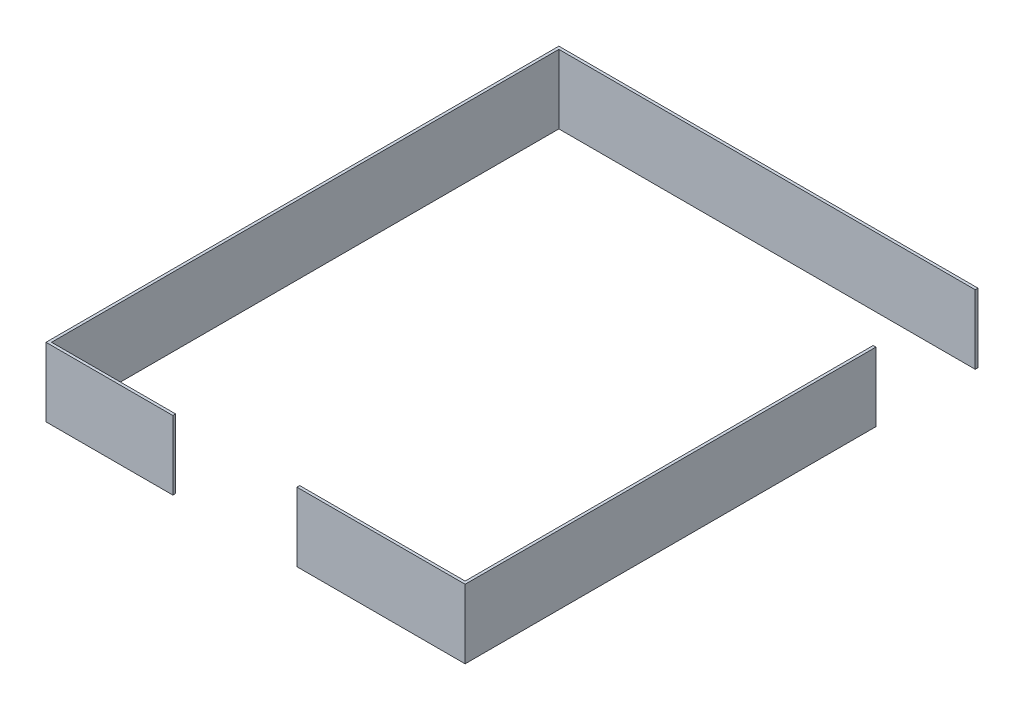
ISO-10303-21;
HEADER;
FILE_DESCRIPTION(('STEP AP214'),'2;1');
FILE_NAME('part.step','',(''),(''),'','','');
FILE_SCHEMA(('AUTOMOTIVE_DESIGN { 1 0 10303 214 1 1 1 1 }'));
ENDSEC;
DATA;
#1=APPLICATION_CONTEXT('core data for automotive mechanical design processes');
#2=APPLICATION_PROTOCOL_DEFINITION('international standard','automotive_design',2000,#1);
#3=PRODUCT_CONTEXT('',#1,'mechanical');
#4=PRODUCT('Part','Part','',(#3));
#5=PRODUCT_RELATED_PRODUCT_CATEGORY('part','',(#4));
#6=PRODUCT_DEFINITION_FORMATION('','',#4);
#7=PRODUCT_DEFINITION_CONTEXT('part definition',#1,'design');
#8=PRODUCT_DEFINITION('design','',#6,#7);
#9=PRODUCT_DEFINITION_SHAPE('','',#8);
#10=(LENGTH_UNIT() NAMED_UNIT(*) SI_UNIT(.MILLI.,.METRE.));
#11=(NAMED_UNIT(*) PLANE_ANGLE_UNIT() SI_UNIT($,.RADIAN.));
#12=(NAMED_UNIT(*) SI_UNIT($,.STERADIAN.) SOLID_ANGLE_UNIT());
#13=UNCERTAINTY_MEASURE_WITH_UNIT(LENGTH_MEASURE(1.E-05),#10,'distance_accuracy_value','');
#14=(GEOMETRIC_REPRESENTATION_CONTEXT(3) GLOBAL_UNCERTAINTY_ASSIGNED_CONTEXT((#13)) GLOBAL_UNIT_ASSIGNED_CONTEXT((#10,
#11,#12)) REPRESENTATION_CONTEXT('',''));
#15=CARTESIAN_POINT('',(0.,0.,0.));
#16=DIRECTION('',(0.,0.,1.));
#17=DIRECTION('',(1.,0.,0.));
#18=AXIS2_PLACEMENT_3D('',#15,#16,#17);
#19=CARTESIAN_POINT('',(0.,250.,0.));
#20=DIRECTION('',(0.,0.,-1.));
#21=DIRECTION('',(-1.,0.,0.));
#22=AXIS2_PLACEMENT_3D('',#19,#20,#21);
#23=PLANE('',#22);
#24=DIRECTION('',(1.,0.,0.));
#25=VECTOR('',#24,1.);
#26=CARTESIAN_POINT('',(0.,250.,0.));
#27=LINE('',#26,#25);
#28=CARTESIAN_POINT('',(0.,250.,0.));
#29=VERTEX_POINT('',#28);
#30=CARTESIAN_POINT('',(600.,250.,0.));
#31=VERTEX_POINT('',#30);
#32=EDGE_CURVE('E107',#29,#31,#27,.T.);
#33=ORIENTED_EDGE('',*,*,#32,.T.);
#34=DIRECTION('',(0.,-1.,0.));
#35=VECTOR('',#34,1.);
#36=CARTESIAN_POINT('',(600.,250.,0.));
#37=LINE('',#36,#35);
#38=CARTESIAN_POINT('',(600.,0.,0.));
#39=VERTEX_POINT('',#38);
#40=EDGE_CURVE('E123',#31,#39,#37,.T.);
#41=ORIENTED_EDGE('',*,*,#40,.T.);
#42=DIRECTION('',(1.,0.,0.));
#43=VECTOR('',#42,1.);
#44=CARTESIAN_POINT('',(0.,0.,0.));
#45=LINE('',#44,#43);
#46=CARTESIAN_POINT('',(0.,0.,0.));
#47=VERTEX_POINT('',#46);
#48=EDGE_CURVE('E136',#47,#39,#45,.T.);
#49=ORIENTED_EDGE('',*,*,#48,.F.);
#50=DIRECTION('',(0.,-1.,0.));
#51=VECTOR('',#50,1.);
#52=CARTESIAN_POINT('',(0.,250.,0.));
#53=LINE('',#52,#51);
#54=EDGE_CURVE('E12',#29,#47,#53,.T.);
#55=ORIENTED_EDGE('',*,*,#54,.F.);
#56=EDGE_LOOP('',(#33,#41,#49,#55));
#57=FACE_BOUND('',#56,.T.);
#58=ADVANCED_FACE('F43',(#57),#23,.T.);
#59=CARTESIAN_POINT('',(610.,250.,0.));
#60=DIRECTION('',(1.,0.,0.));
#61=DIRECTION('',(0.,0.,-1.));
#62=AXIS2_PLACEMENT_3D('',#59,#60,#61);
#63=PLANE('',#62);
#64=DIRECTION('',(0.,0.,1.));
#65=VECTOR('',#64,1.);
#66=CARTESIAN_POINT('',(610.,0.,0.));
#67=LINE('',#66,#65);
#68=CARTESIAN_POINT('',(610.,0.,-1480.));
#69=VERTEX_POINT('',#68);
#70=CARTESIAN_POINT('',(610.,0.,10.));
#71=VERTEX_POINT('',#70);
#72=EDGE_CURVE('E113',#69,#71,#67,.T.);
#73=ORIENTED_EDGE('',*,*,#72,.F.);
#74=DIRECTION('',(0.,-1.,0.));
#75=VECTOR('',#74,1.);
#76=CARTESIAN_POINT('',(610.,250.,-1480.));
#77=LINE('',#76,#75);
#78=CARTESIAN_POINT('',(610.,250.,-1480.));
#79=VERTEX_POINT('',#78);
#80=EDGE_CURVE('E111',#79,#69,#77,.T.);
#81=ORIENTED_EDGE('',*,*,#80,.F.);
#82=DIRECTION('',(0.,0.,1.));
#83=VECTOR('',#82,1.);
#84=CARTESIAN_POINT('',(610.,250.,0.));
#85=LINE('',#84,#83);
#86=CARTESIAN_POINT('',(610.,250.,10.));
#87=VERTEX_POINT('',#86);
#88=EDGE_CURVE('E102',#79,#87,#85,.T.);
#89=ORIENTED_EDGE('',*,*,#88,.T.);
#90=DIRECTION('',(0.,-1.,0.));
#91=VECTOR('',#90,1.);
#92=CARTESIAN_POINT('',(610.,250.,10.));
#93=LINE('',#92,#91);
#94=EDGE_CURVE('E83',#87,#71,#93,.T.);
#95=ORIENTED_EDGE('',*,*,#94,.T.);
#96=EDGE_LOOP('',(#73,#81,#89,#95));
#97=FACE_BOUND('',#96,.T.);
#98=ADVANCED_FACE('F45',(#97),#63,.T.);
#99=CARTESIAN_POINT('',(0.,250.,0.));
#100=DIRECTION('',(1.,0.,0.));
#101=DIRECTION('',(0.,0.,-1.));
#102=AXIS2_PLACEMENT_3D('',#99,#100,#101);
#103=PLANE('',#102);
#104=DIRECTION('',(0.,0.,1.));
#105=VECTOR('',#104,1.);
#106=CARTESIAN_POINT('',(0.,0.,0.));
#107=LINE('',#106,#105);
#108=CARTESIAN_POINT('',(0.,0.,10.));
#109=VERTEX_POINT('',#108);
#110=EDGE_CURVE('E139',#47,#109,#107,.T.);
#111=ORIENTED_EDGE('',*,*,#110,.T.);
#112=DIRECTION('',(0.,-1.,0.));
#113=VECTOR('',#112,1.);
#114=CARTESIAN_POINT('',(0.,250.,10.));
#115=LINE('',#114,#113);
#116=CARTESIAN_POINT('',(0.,250.,10.));
#117=VERTEX_POINT('',#116);
#118=EDGE_CURVE('E51',#117,#109,#115,.T.);
#119=ORIENTED_EDGE('',*,*,#118,.F.);
#120=DIRECTION('',(0.,0.,1.));
#121=VECTOR('',#120,1.);
#122=CARTESIAN_POINT('',(0.,250.,0.));
#123=LINE('',#122,#121);
#124=EDGE_CURVE('E132',#29,#117,#123,.T.);
#125=ORIENTED_EDGE('',*,*,#124,.F.);
#126=ORIENTED_EDGE('',*,*,#54,.T.);
#127=EDGE_LOOP('',(#111,#119,#125,#126));
#128=FACE_BOUND('',#127,.T.);
#129=ADVANCED_FACE('F153',(#128),#103,.F.);
#130=CARTESIAN_POINT('',(0.,250.,10.));
#131=DIRECTION('',(0.,0.,-1.));
#132=DIRECTION('',(-1.,0.,0.));
#133=AXIS2_PLACEMENT_3D('',#130,#131,#132);
#134=PLANE('',#133);
#135=DIRECTION('',(1.,0.,0.));
#136=VECTOR('',#135,1.);
#137=CARTESIAN_POINT('',(0.,0.,10.));
#138=LINE('',#137,#136);
#139=EDGE_CURVE('E108',#109,#71,#138,.T.);
#140=ORIENTED_EDGE('',*,*,#139,.T.);
#141=ORIENTED_EDGE('',*,*,#94,.F.);
#142=DIRECTION('',(1.,0.,0.));
#143=VECTOR('',#142,1.);
#144=CARTESIAN_POINT('',(0.,250.,10.));
#145=LINE('',#144,#143);
#146=EDGE_CURVE('E67',#117,#87,#145,.T.);
#147=ORIENTED_EDGE('',*,*,#146,.F.);
#148=ORIENTED_EDGE('',*,*,#118,.T.);
#149=EDGE_LOOP('',(#140,#141,#147,#148));
#150=FACE_BOUND('',#149,.T.);
#151=ADVANCED_FACE('F146',(#150),#134,.F.);
#152=CARTESIAN_POINT('',(0.,250.,0.));
#153=DIRECTION('',(0.,1.,0.));
#154=DIRECTION('',(0.,0.,1.));
#155=AXIS2_PLACEMENT_3D('',#152,#153,#154);
#156=PLANE('',#155);
#157=ORIENTED_EDGE('',*,*,#88,.F.);
#158=DIRECTION('',(1.,0.,0.));
#159=VECTOR('',#158,1.);
#160=CARTESIAN_POINT('',(0.,250.,-1480.));
#161=LINE('',#160,#159);
#162=CARTESIAN_POINT('',(600.,250.,-1480.));
#163=VERTEX_POINT('',#162);
#164=EDGE_CURVE('E106',#163,#79,#161,.T.);
#165=ORIENTED_EDGE('',*,*,#164,.F.);
#166=DIRECTION('',(0.,0.,1.));
#167=VECTOR('',#166,1.);
#168=CARTESIAN_POINT('',(600.,250.,0.));
#169=LINE('',#168,#167);
#170=EDGE_CURVE('E121',#163,#31,#169,.T.);
#171=ORIENTED_EDGE('',*,*,#170,.T.);
#172=ORIENTED_EDGE('',*,*,#32,.F.);
#173=ORIENTED_EDGE('',*,*,#124,.T.);
#174=ORIENTED_EDGE('',*,*,#146,.T.);
#175=EDGE_LOOP('',(#157,#165,#171,#172,#173,#174));
#176=FACE_BOUND('',#175,.T.);
#177=ADVANCED_FACE('F104',(#176),#156,.T.);
#178=CARTESIAN_POINT('',(0.,0.,0.));
#179=DIRECTION('',(0.,1.,0.));
#180=DIRECTION('',(0.,0.,1.));
#181=AXIS2_PLACEMENT_3D('',#178,#179,#180);
#182=PLANE('',#181);
#183=ORIENTED_EDGE('',*,*,#72,.T.);
#184=ORIENTED_EDGE('',*,*,#139,.F.);
#185=ORIENTED_EDGE('',*,*,#110,.F.);
#186=ORIENTED_EDGE('',*,*,#48,.T.);
#187=DIRECTION('',(0.,0.,1.));
#188=VECTOR('',#187,1.);
#189=CARTESIAN_POINT('',(600.,0.,0.));
#190=LINE('',#189,#188);
#191=CARTESIAN_POINT('',(600.,0.,-1480.));
#192=VERTEX_POINT('',#191);
#193=EDGE_CURVE('E58',#192,#39,#190,.T.);
#194=ORIENTED_EDGE('',*,*,#193,.F.);
#195=DIRECTION('',(1.,0.,0.));
#196=VECTOR('',#195,1.);
#197=CARTESIAN_POINT('',(0.,0.,-1480.));
#198=LINE('',#197,#196);
#199=EDGE_CURVE('E125',#192,#69,#198,.T.);
#200=ORIENTED_EDGE('',*,*,#199,.T.);
#201=EDGE_LOOP('',(#183,#184,#185,#186,#194,#200));
#202=FACE_BOUND('',#201,.T.);
#203=ADVANCED_FACE('F150',(#202),#182,.F.);
#204=CARTESIAN_POINT('',(0.,250.,-1480.));
#205=DIRECTION('',(0.,0.,-1.));
#206=DIRECTION('',(-1.,0.,0.));
#207=AXIS2_PLACEMENT_3D('',#204,#205,#206);
#208=PLANE('',#207);
#209=ORIENTED_EDGE('',*,*,#199,.F.);
#210=DIRECTION('',(0.,-1.,0.));
#211=VECTOR('',#210,1.);
#212=CARTESIAN_POINT('',(600.,250.,-1480.));
#213=LINE('',#212,#211);
#214=EDGE_CURVE('E117',#163,#192,#213,.T.);
#215=ORIENTED_EDGE('',*,*,#214,.F.);
#216=ORIENTED_EDGE('',*,*,#164,.T.);
#217=ORIENTED_EDGE('',*,*,#80,.T.);
#218=EDGE_LOOP('',(#209,#215,#216,#217));
#219=FACE_BOUND('',#218,.T.);
#220=ADVANCED_FACE('F119',(#219),#208,.T.);
#221=CARTESIAN_POINT('',(600.,250.,0.));
#222=DIRECTION('',(1.,0.,0.));
#223=DIRECTION('',(0.,0.,-1.));
#224=AXIS2_PLACEMENT_3D('',#221,#222,#223);
#225=PLANE('',#224);
#226=ORIENTED_EDGE('',*,*,#193,.T.);
#227=ORIENTED_EDGE('',*,*,#40,.F.);
#228=ORIENTED_EDGE('',*,*,#170,.F.);
#229=ORIENTED_EDGE('',*,*,#214,.T.);
#230=EDGE_LOOP('',(#226,#227,#228,#229));
#231=FACE_BOUND('',#230,.T.);
#232=ADVANCED_FACE('F152',(#231),#225,.F.);
#233=CLOSED_SHELL('',(#58,#98,#129,#151,#177,#203,#220,#232));
#234=MANIFOLD_SOLID_BREP('B2',#233);
#235=CARTESIAN_POINT('',(-450.,250.,0.));
#236=DIRECTION('',(0.,0.,1.));
#237=DIRECTION('',(1.,0.,0.));
#238=AXIS2_PLACEMENT_3D('',#235,#236,#237);
#239=PLANE('',#238);
#240=DIRECTION('',(0.,-1.,0.));
#241=VECTOR('',#240,1.);
#242=CARTESIAN_POINT('',(-900.000000000001,250.,0.));
#243=LINE('',#242,#241);
#244=CARTESIAN_POINT('',(-900.000000000001,250.,0.));
#245=VERTEX_POINT('',#244);
#246=CARTESIAN_POINT('',(-900.000000000001,0.,0.));
#247=VERTEX_POINT('',#246);
#248=EDGE_CURVE('E328',#245,#247,#243,.T.);
#249=ORIENTED_EDGE('',*,*,#248,.F.);
#250=DIRECTION('',(-1.,0.,0.));
#251=VECTOR('',#250,1.);
#252=CARTESIAN_POINT('',(-450.,250.,0.));
#253=LINE('',#252,#251);
#254=CARTESIAN_POINT('',(-450.,250.,0.));
#255=VERTEX_POINT('',#254);
#256=EDGE_CURVE('E336',#255,#245,#253,.T.);
#257=ORIENTED_EDGE('',*,*,#256,.F.);
#258=DIRECTION('',(0.,-1.,0.));
#259=VECTOR('',#258,1.);
#260=CARTESIAN_POINT('',(-450.,250.,0.));
#261=LINE('',#260,#259);
#262=CARTESIAN_POINT('',(-450.,0.,0.));
#263=VERTEX_POINT('',#262);
#264=EDGE_CURVE('E232',#255,#263,#261,.T.);
#265=ORIENTED_EDGE('',*,*,#264,.T.);
#266=DIRECTION('',(-1.,0.,0.));
#267=VECTOR('',#266,1.);
#268=CARTESIAN_POINT('',(-450.,0.,0.));
#269=LINE('',#268,#267);
#270=EDGE_CURVE('E346',#263,#247,#269,.T.);
#271=ORIENTED_EDGE('',*,*,#270,.T.);
#272=EDGE_LOOP('',(#249,#257,#265,#271));
#273=FACE_BOUND('',#272,.T.);
#274=ADVANCED_FACE('F228',(#273),#239,.F.);
#275=CARTESIAN_POINT('',(-910.,250.,10.));
#276=DIRECTION('',(-1.,0.,0.));
#277=DIRECTION('',(0.,0.,1.));
#278=AXIS2_PLACEMENT_3D('',#275,#276,#277);
#279=PLANE('',#278);
#280=DIRECTION('',(0.,0.,-1.));
#281=VECTOR('',#280,1.);
#282=CARTESIAN_POINT('',(-910.,0.,10.));
#283=LINE('',#282,#281);
#284=CARTESIAN_POINT('',(-910.,0.,10.));
#285=VERTEX_POINT('',#284);
#286=CARTESIAN_POINT('',(-910.000000000001,0.,-1850.));
#287=VERTEX_POINT('',#286);
#288=EDGE_CURVE('E333',#285,#287,#283,.T.);
#289=ORIENTED_EDGE('',*,*,#288,.F.);
#290=DIRECTION('',(0.,-1.,0.));
#291=VECTOR('',#290,1.);
#292=CARTESIAN_POINT('',(-910.,250.,10.));
#293=LINE('',#292,#291);
#294=CARTESIAN_POINT('',(-910.,250.,10.));
#295=VERTEX_POINT('',#294);
#296=EDGE_CURVE('E41',#295,#285,#293,.T.);
#297=ORIENTED_EDGE('',*,*,#296,.F.);
#298=DIRECTION('',(0.,0.,-1.));
#299=VECTOR('',#298,1.);
#300=CARTESIAN_POINT('',(-910.,250.,10.));
#301=LINE('',#300,#299);
#302=CARTESIAN_POINT('',(-910.000000000001,250.,-1850.));
#303=VERTEX_POINT('',#302);
#304=EDGE_CURVE('E334',#295,#303,#301,.T.);
#305=ORIENTED_EDGE('',*,*,#304,.T.);
#306=DIRECTION('',(0.,-1.,0.));
#307=VECTOR('',#306,1.);
#308=CARTESIAN_POINT('',(-910.000000000001,250.,-1850.));
#309=LINE('',#308,#307);
#310=EDGE_CURVE('E306',#303,#287,#309,.T.);
#311=ORIENTED_EDGE('',*,*,#310,.T.);
#312=EDGE_LOOP('',(#289,#297,#305,#311));
#313=FACE_BOUND('',#312,.T.);
#314=ADVANCED_FACE('F230',(#313),#279,.T.);
#315=CARTESIAN_POINT('',(-450.,250.,10.));
#316=DIRECTION('',(0.,0.,1.));
#317=DIRECTION('',(1.,0.,0.));
#318=AXIS2_PLACEMENT_3D('',#315,#316,#317);
#319=PLANE('',#318);
#320=DIRECTION('',(-1.,0.,0.));
#321=VECTOR('',#320,1.);
#322=CARTESIAN_POINT('',(-450.,0.,10.));
#323=LINE('',#322,#321);
#324=CARTESIAN_POINT('',(-450.,0.,10.));
#325=VERTEX_POINT('',#324);
#326=EDGE_CURVE('E337',#325,#285,#323,.T.);
#327=ORIENTED_EDGE('',*,*,#326,.F.);
#328=DIRECTION('',(0.,-1.,0.));
#329=VECTOR('',#328,1.);
#330=CARTESIAN_POINT('',(-450.,250.,10.));
#331=LINE('',#330,#329);
#332=CARTESIAN_POINT('',(-450.,250.,10.));
#333=VERTEX_POINT('',#332);
#334=EDGE_CURVE('E237',#333,#325,#331,.T.);
#335=ORIENTED_EDGE('',*,*,#334,.F.);
#336=DIRECTION('',(-1.,0.,0.));
#337=VECTOR('',#336,1.);
#338=CARTESIAN_POINT('',(-450.,250.,10.));
#339=LINE('',#338,#337);
#340=EDGE_CURVE('E342',#333,#295,#339,.T.);
#341=ORIENTED_EDGE('',*,*,#340,.T.);
#342=ORIENTED_EDGE('',*,*,#296,.T.);
#343=EDGE_LOOP('',(#327,#335,#341,#342));
#344=FACE_BOUND('',#343,.T.);
#345=ADVANCED_FACE('F367',(#344),#319,.T.);
#346=CARTESIAN_POINT('',(-450.,250.,10.));
#347=DIRECTION('',(-1.,0.,0.));
#348=DIRECTION('',(0.,0.,1.));
#349=AXIS2_PLACEMENT_3D('',#346,#347,#348);
#350=PLANE('',#349);
#351=DIRECTION('',(0.,0.,-1.));
#352=VECTOR('',#351,1.);
#353=CARTESIAN_POINT('',(-450.,0.,10.));
#354=LINE('',#353,#352);
#355=EDGE_CURVE('E349',#325,#263,#354,.T.);
#356=ORIENTED_EDGE('',*,*,#355,.T.);
#357=ORIENTED_EDGE('',*,*,#264,.F.);
#358=DIRECTION('',(0.,0.,-1.));
#359=VECTOR('',#358,1.);
#360=CARTESIAN_POINT('',(-450.,250.,10.));
#361=LINE('',#360,#359);
#362=EDGE_CURVE('E340',#333,#255,#361,.T.);
#363=ORIENTED_EDGE('',*,*,#362,.F.);
#364=ORIENTED_EDGE('',*,*,#334,.T.);
#365=EDGE_LOOP('',(#356,#357,#363,#364));
#366=FACE_BOUND('',#365,.T.);
#367=ADVANCED_FACE('F365',(#366),#350,.F.);
#368=CARTESIAN_POINT('',(0.,250.,0.));
#369=DIRECTION('',(0.,1.,0.));
#370=DIRECTION('',(0.,0.,1.));
#371=AXIS2_PLACEMENT_3D('',#368,#369,#370);
#372=PLANE('',#371);
#373=ORIENTED_EDGE('',*,*,#304,.F.);
#374=ORIENTED_EDGE('',*,*,#340,.F.);
#375=ORIENTED_EDGE('',*,*,#362,.T.);
#376=ORIENTED_EDGE('',*,*,#256,.T.);
#377=DIRECTION('',(0.,0.,1.));
#378=VECTOR('',#377,1.);
#379=CARTESIAN_POINT('',(-900.,250.,1.08021699693259E-13));
#380=LINE('',#379,#378);
#381=CARTESIAN_POINT('',(-900.000000000001,250.,-1840.));
#382=VERTEX_POINT('',#381);
#383=EDGE_CURVE('E253',#382,#245,#380,.T.);
#384=ORIENTED_EDGE('',*,*,#383,.F.);
#385=DIRECTION('',(-1.,0.,0.));
#386=VECTOR('',#385,1.);
#387=CARTESIAN_POINT('',(-2.70570909312621E-13,250.,-1840.));
#388=LINE('',#387,#386);
#389=CARTESIAN_POINT('',(609.999999999999,250.,-1840.));
#390=VERTEX_POINT('',#389);
#391=EDGE_CURVE('E315',#390,#382,#388,.T.);
#392=ORIENTED_EDGE('',*,*,#391,.F.);
#393=DIRECTION('',(0.,0.,-1.));
#394=VECTOR('',#393,1.);
#395=CARTESIAN_POINT('',(609.999999999999,250.,0.));
#396=LINE('',#395,#394);
#397=CARTESIAN_POINT('',(609.999999999999,250.,-1850.));
#398=VERTEX_POINT('',#397);
#399=EDGE_CURVE('E313',#390,#398,#396,.T.);
#400=ORIENTED_EDGE('',*,*,#399,.T.);
#401=DIRECTION('',(-1.,0.,0.));
#402=VECTOR('',#401,1.);
#403=CARTESIAN_POINT('',(0.,250.,-1850.));
#404=LINE('',#403,#402);
#405=EDGE_CURVE('E298',#398,#303,#404,.T.);
#406=ORIENTED_EDGE('',*,*,#405,.T.);
#407=EDGE_LOOP('',(#373,#374,#375,#376,#384,#392,#400,#406));
#408=FACE_BOUND('',#407,.T.);
#409=ADVANCED_FACE('F314',(#408),#372,.T.);
#410=CARTESIAN_POINT('',(0.,0.,0.));
#411=DIRECTION('',(0.,1.,0.));
#412=DIRECTION('',(0.,0.,1.));
#413=AXIS2_PLACEMENT_3D('',#410,#411,#412);
#414=PLANE('',#413);
#415=ORIENTED_EDGE('',*,*,#288,.T.);
#416=DIRECTION('',(-1.,0.,0.));
#417=VECTOR('',#416,1.);
#418=CARTESIAN_POINT('',(0.,0.,-1850.));
#419=LINE('',#418,#417);
#420=CARTESIAN_POINT('',(609.999999999999,0.,-1850.));
#421=VERTEX_POINT('',#420);
#422=EDGE_CURVE('E320',#421,#287,#419,.T.);
#423=ORIENTED_EDGE('',*,*,#422,.F.);
#424=DIRECTION('',(0.,0.,-1.));
#425=VECTOR('',#424,1.);
#426=CARTESIAN_POINT('',(609.999999999999,0.,0.));
#427=LINE('',#426,#425);
#428=CARTESIAN_POINT('',(609.999999999999,0.,-1840.));
#429=VERTEX_POINT('',#428);
#430=EDGE_CURVE('E319',#429,#421,#427,.T.);
#431=ORIENTED_EDGE('',*,*,#430,.F.);
#432=DIRECTION('',(-1.,0.,0.));
#433=VECTOR('',#432,1.);
#434=CARTESIAN_POINT('',(-2.70570909312621E-13,0.,-1840.));
#435=LINE('',#434,#433);
#436=CARTESIAN_POINT('',(-900.000000000001,0.,-1840.));
#437=VERTEX_POINT('',#436);
#438=EDGE_CURVE('E245',#429,#437,#435,.T.);
#439=ORIENTED_EDGE('',*,*,#438,.T.);
#440=DIRECTION('',(0.,0.,1.));
#441=VECTOR('',#440,1.);
#442=CARTESIAN_POINT('',(-900.,0.,1.08021699693259E-13));
#443=LINE('',#442,#441);
#444=EDGE_CURVE('E309',#437,#247,#443,.T.);
#445=ORIENTED_EDGE('',*,*,#444,.T.);
#446=ORIENTED_EDGE('',*,*,#270,.F.);
#447=ORIENTED_EDGE('',*,*,#355,.F.);
#448=ORIENTED_EDGE('',*,*,#326,.T.);
#449=EDGE_LOOP('',(#415,#423,#431,#439,#445,#446,#447,#448));
#450=FACE_BOUND('',#449,.T.);
#451=ADVANCED_FACE('F360',(#450),#414,.F.);
#452=CARTESIAN_POINT('',(0.,250.,-1850.));
#453=DIRECTION('',(0.,0.,1.));
#454=DIRECTION('',(1.,0.,0.));
#455=AXIS2_PLACEMENT_3D('',#452,#453,#454);
#456=PLANE('',#455);
#457=ORIENTED_EDGE('',*,*,#422,.T.);
#458=ORIENTED_EDGE('',*,*,#310,.F.);
#459=ORIENTED_EDGE('',*,*,#405,.F.);
#460=DIRECTION('',(0.,-1.,0.));
#461=VECTOR('',#460,1.);
#462=CARTESIAN_POINT('',(609.999999999999,250.,-1850.));
#463=LINE('',#462,#461);
#464=EDGE_CURVE('E303',#398,#421,#463,.T.);
#465=ORIENTED_EDGE('',*,*,#464,.T.);
#466=EDGE_LOOP('',(#457,#458,#459,#465));
#467=FACE_BOUND('',#466,.T.);
#468=ADVANCED_FACE('F301',(#467),#456,.F.);
#469=CARTESIAN_POINT('',(-900.,250.,1.08021699693259E-13));
#470=DIRECTION('',(1.,0.,0.));
#471=DIRECTION('',(0.,0.,-1.));
#472=AXIS2_PLACEMENT_3D('',#469,#470,#471);
#473=PLANE('',#472);
#474=DIRECTION('',(0.,-1.,0.));
#475=VECTOR('',#474,1.);
#476=CARTESIAN_POINT('',(-900.000000000001,250.,-1840.));
#477=LINE('',#476,#475);
#478=EDGE_CURVE('E321',#382,#437,#477,.T.);
#479=ORIENTED_EDGE('',*,*,#478,.F.);
#480=ORIENTED_EDGE('',*,*,#383,.T.);
#481=ORIENTED_EDGE('',*,*,#248,.T.);
#482=ORIENTED_EDGE('',*,*,#444,.F.);
#483=EDGE_LOOP('',(#479,#480,#481,#482));
#484=FACE_BOUND('',#483,.T.);
#485=ADVANCED_FACE('F363',(#484),#473,.T.);
#486=CARTESIAN_POINT('',(609.999999999999,250.,0.));
#487=DIRECTION('',(-1.,0.,0.));
#488=DIRECTION('',(0.,0.,1.));
#489=AXIS2_PLACEMENT_3D('',#486,#487,#488);
#490=PLANE('',#489);
#491=ORIENTED_EDGE('',*,*,#430,.T.);
#492=ORIENTED_EDGE('',*,*,#464,.F.);
#493=ORIENTED_EDGE('',*,*,#399,.F.);
#494=DIRECTION('',(0.,-1.,0.));
#495=VECTOR('',#494,1.);
#496=CARTESIAN_POINT('',(609.999999999999,250.,-1840.));
#497=LINE('',#496,#495);
#498=EDGE_CURVE('E324',#390,#429,#497,.T.);
#499=ORIENTED_EDGE('',*,*,#498,.T.);
#500=EDGE_LOOP('',(#491,#492,#493,#499));
#501=FACE_BOUND('',#500,.T.);
#502=ADVANCED_FACE('F318',(#501),#490,.F.);
#503=CARTESIAN_POINT('',(-2.70570909312621E-13,250.,-1840.));
#504=DIRECTION('',(0.,0.,1.));
#505=DIRECTION('',(1.,0.,0.));
#506=AXIS2_PLACEMENT_3D('',#503,#504,#505);
#507=PLANE('',#506);
#508=ORIENTED_EDGE('',*,*,#438,.F.);
#509=ORIENTED_EDGE('',*,*,#498,.F.);
#510=ORIENTED_EDGE('',*,*,#391,.T.);
#511=ORIENTED_EDGE('',*,*,#478,.T.);
#512=EDGE_LOOP('',(#508,#509,#510,#511));
#513=FACE_BOUND('',#512,.T.);
#514=ADVANCED_FACE('F386',(#513),#507,.T.);
#515=CLOSED_SHELL('',(#274,#314,#345,#367,#409,#451,#468,#485,#502,#514));
#516=MANIFOLD_SOLID_BREP('B6',#515);
#517=ADVANCED_BREP_SHAPE_REPRESENTATION('',(#18,#234,#516),#14);
#518=SHAPE_DEFINITION_REPRESENTATION(#9,#517);
ENDSEC;
END-ISO-10303-21;
